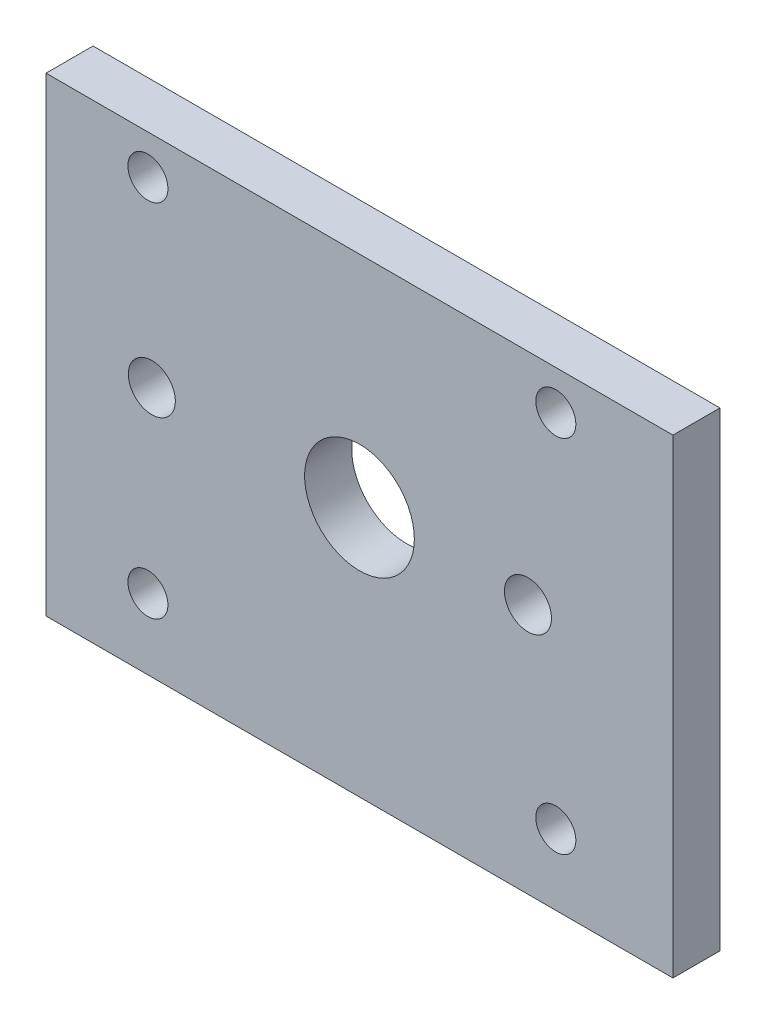
ISO-10303-21;
HEADER;
FILE_DESCRIPTION(('STEP AP214'),'2;1');
FILE_NAME('part.step','',(''),(''),'','','');
FILE_SCHEMA(('AUTOMOTIVE_DESIGN { 1 0 10303 214 1 1 1 1 }'));
ENDSEC;
DATA;
#1=APPLICATION_CONTEXT('core data for automotive mechanical design processes');
#2=APPLICATION_PROTOCOL_DEFINITION('international standard','automotive_design',2000,#1);
#3=PRODUCT_CONTEXT('',#1,'mechanical');
#4=PRODUCT('Part','Part','',(#3));
#5=PRODUCT_RELATED_PRODUCT_CATEGORY('part','',(#4));
#6=PRODUCT_DEFINITION_FORMATION('','',#4);
#7=PRODUCT_DEFINITION_CONTEXT('part definition',#1,'design');
#8=PRODUCT_DEFINITION('design','',#6,#7);
#9=PRODUCT_DEFINITION_SHAPE('','',#8);
#10=(LENGTH_UNIT() NAMED_UNIT(*) SI_UNIT(.MILLI.,.METRE.));
#11=(NAMED_UNIT(*) PLANE_ANGLE_UNIT() SI_UNIT($,.RADIAN.));
#12=(NAMED_UNIT(*) SI_UNIT($,.STERADIAN.) SOLID_ANGLE_UNIT());
#13=UNCERTAINTY_MEASURE_WITH_UNIT(LENGTH_MEASURE(1.E-05),#10,'distance_accuracy_value','');
#14=(GEOMETRIC_REPRESENTATION_CONTEXT(3) GLOBAL_UNCERTAINTY_ASSIGNED_CONTEXT((#13)) GLOBAL_UNIT_ASSIGNED_CONTEXT((#10,
#11,#12)) REPRESENTATION_CONTEXT('',''));
#15=CARTESIAN_POINT('',(0.,0.,0.));
#16=DIRECTION('',(0.,0.,1.));
#17=DIRECTION('',(1.,0.,0.));
#18=AXIS2_PLACEMENT_3D('',#15,#16,#17);
#19=CARTESIAN_POINT('',(0.,0.,6.));
#20=DIRECTION('',(0.,0.,-1.));
#21=DIRECTION('',(-1.,0.,0.));
#22=AXIS2_PLACEMENT_3D('',#19,#20,#21);
#23=PLANE('',#22);
#24=CARTESIAN_POINT('',(25.0526267781055,29.9999999999994,6.));
#25=DIRECTION('',(0.,0.,-1.));
#26=DIRECTION('',(-1.,0.,0.));
#27=AXIS2_PLACEMENT_3D('',#24,#25,#26);
#28=CIRCLE('',#27,2.55508771063859);
#29=CARTESIAN_POINT('',(22.4975390674669,29.9999999999994,6.));
#30=VERTEX_POINT('',#29);
#31=EDGE_CURVE('E123',#30,#30,#28,.T.);
#32=ORIENTED_EDGE('',*,*,#31,.T.);
#33=EDGE_LOOP('',(#32));
#34=FACE_BOUND('',#33,.T.);
#35=CARTESIAN_POINT('',(25.0526267781055,-16.0000000000006,6.));
#36=DIRECTION('',(0.,0.,-1.));
#37=DIRECTION('',(-1.,0.,0.));
#38=AXIS2_PLACEMENT_3D('',#35,#36,#37);
#39=CIRCLE('',#38,2.55508771063859);
#40=CARTESIAN_POINT('',(22.4975390674669,-16.0000000000006,6.));
#41=VERTEX_POINT('',#40);
#42=EDGE_CURVE('E126',#41,#41,#39,.T.);
#43=ORIENTED_EDGE('',*,*,#42,.T.);
#44=EDGE_LOOP('',(#43));
#45=FACE_BOUND('',#44,.T.);
#46=CARTESIAN_POINT('',(-27.0000000000308,-16.0000000000006,6.));
#47=DIRECTION('',(0.,0.,-1.));
#48=DIRECTION('',(-1.,0.,0.));
#49=AXIS2_PLACEMENT_3D('',#46,#47,#48);
#50=CIRCLE('',#49,2.55508771063859);
#51=CARTESIAN_POINT('',(-29.5550877106694,-16.0000000000006,6.));
#52=VERTEX_POINT('',#51);
#53=EDGE_CURVE('E129',#52,#52,#50,.T.);
#54=ORIENTED_EDGE('',*,*,#53,.T.);
#55=EDGE_LOOP('',(#54));
#56=FACE_BOUND('',#55,.T.);
#57=CARTESIAN_POINT('',(-27.0000000000308,29.9999999999994,6.));
#58=DIRECTION('',(0.,0.,-1.));
#59=DIRECTION('',(-1.,0.,0.));
#60=AXIS2_PLACEMENT_3D('',#57,#58,#59);
#61=CIRCLE('',#60,2.55508771063859);
#62=CARTESIAN_POINT('',(-29.5550877106694,29.9999999999994,6.));
#63=VERTEX_POINT('',#62);
#64=EDGE_CURVE('E132',#63,#63,#61,.T.);
#65=ORIENTED_EDGE('',*,*,#64,.T.);
#66=EDGE_LOOP('',(#65));
#67=FACE_BOUND('',#66,.T.);
#68=CARTESIAN_POINT('',(-26.5000000000257,7.00000000000068,6.));
#69=DIRECTION('',(0.,0.,-1.));
#70=DIRECTION('',(-1.,0.,0.));
#71=AXIS2_PLACEMENT_3D('',#68,#69,#70);
#72=CIRCLE('',#71,2.99999999999999);
#73=CARTESIAN_POINT('',(-29.5000000000257,7.00000000000068,6.));
#74=VERTEX_POINT('',#73);
#75=EDGE_CURVE('E135',#74,#74,#72,.T.);
#76=ORIENTED_EDGE('',*,*,#75,.T.);
#77=EDGE_LOOP('',(#76));
#78=FACE_BOUND('',#77,.T.);
#79=CARTESIAN_POINT('',(21.4999999999743,6.99999999999966,6.));
#80=DIRECTION('',(0.,0.,-1.));
#81=DIRECTION('',(-1.,0.,0.));
#82=AXIS2_PLACEMENT_3D('',#79,#80,#81);
#83=CIRCLE('',#82,2.99999999999999);
#84=CARTESIAN_POINT('',(18.4999999999743,6.99999999999966,6.));
#85=VERTEX_POINT('',#84);
#86=EDGE_CURVE('E115',#85,#85,#83,.T.);
#87=ORIENTED_EDGE('',*,*,#86,.T.);
#88=EDGE_LOOP('',(#87));
#89=FACE_BOUND('',#88,.T.);
#90=DIRECTION('',(-1.,0.,0.));
#91=VECTOR('',#90,1.);
#92=CARTESIAN_POINT('',(-40.0000000000308,35.0000000000011,6.));
#93=LINE('',#92,#91);
#94=CARTESIAN_POINT('',(39.9999999999692,34.9999999999994,6.));
#95=VERTEX_POINT('',#94);
#96=CARTESIAN_POINT('',(-40.0000000000308,35.0000000000011,6.));
#97=VERTEX_POINT('',#96);
#98=EDGE_CURVE('E85',#95,#97,#93,.T.);
#99=ORIENTED_EDGE('',*,*,#98,.T.);
#100=DIRECTION('',(0.,-1.,0.));
#101=VECTOR('',#100,1.);
#102=CARTESIAN_POINT('',(-40.000000000032,-24.9999999999989,6.));
#103=LINE('',#102,#101);
#104=CARTESIAN_POINT('',(-40.000000000032,-24.9999999999989,6.));
#105=VERTEX_POINT('',#104);
#106=EDGE_CURVE('E80',#97,#105,#103,.T.);
#107=ORIENTED_EDGE('',*,*,#106,.T.);
#108=DIRECTION('',(1.,0.,0.));
#109=VECTOR('',#108,1.);
#110=CARTESIAN_POINT('',(-40.000000000032,-24.9999999999989,6.));
#111=LINE('',#110,#109);
#112=CARTESIAN_POINT('',(39.999999999968,-24.9999999999989,6.));
#113=VERTEX_POINT('',#112);
#114=EDGE_CURVE('E83',#105,#113,#111,.T.);
#115=ORIENTED_EDGE('',*,*,#114,.T.);
#116=DIRECTION('',(0.,1.,0.));
#117=VECTOR('',#116,1.);
#118=CARTESIAN_POINT('',(39.9999999999692,34.9999999999994,6.));
#119=LINE('',#118,#117);
#120=EDGE_CURVE('E50',#113,#95,#119,.T.);
#121=ORIENTED_EDGE('',*,*,#120,.T.);
#122=EDGE_LOOP('',(#99,#107,#115,#121));
#123=FACE_BOUND('',#122,.T.);
#124=CARTESIAN_POINT('',(-3.13596870453245E-11,7.00000000000025,6.));
#125=DIRECTION('',(0.,0.,1.));
#126=DIRECTION('',(1.,0.,0.));
#127=AXIS2_PLACEMENT_3D('',#124,#125,#126);
#128=CIRCLE('',#127,7.);
#129=CARTESIAN_POINT('',(6.99999999996864,7.00000000000025,6.));
#130=VERTEX_POINT('',#129);
#131=EDGE_CURVE('E100',#130,#130,#128,.T.);
#132=ORIENTED_EDGE('',*,*,#131,.F.);
#133=EDGE_LOOP('',(#132));
#134=FACE_BOUND('',#133,.T.);
#135=ADVANCED_FACE('F33',(#34,#45,#56,#67,#78,#89,#123,#134),#23,.F.);
#136=CARTESIAN_POINT('',(0.,0.,0.));
#137=DIRECTION('',(0.,0.,-1.));
#138=DIRECTION('',(-1.,0.,0.));
#139=AXIS2_PLACEMENT_3D('',#136,#137,#138);
#140=PLANE('',#139);
#141=CARTESIAN_POINT('',(25.0526267781055,29.9999999999994,0.));
#142=DIRECTION('',(0.,0.,-1.));
#143=DIRECTION('',(-1.,0.,0.));
#144=AXIS2_PLACEMENT_3D('',#141,#142,#143);
#145=CIRCLE('',#144,2.55508771063859);
#146=CARTESIAN_POINT('',(22.4975390674669,29.9999999999994,0.));
#147=VERTEX_POINT('',#146);
#148=EDGE_CURVE('E145',#147,#147,#145,.T.);
#149=ORIENTED_EDGE('',*,*,#148,.F.);
#150=EDGE_LOOP('',(#149));
#151=FACE_BOUND('',#150,.T.);
#152=CARTESIAN_POINT('',(25.0526267781055,-16.0000000000006,0.));
#153=DIRECTION('',(0.,0.,-1.));
#154=DIRECTION('',(-1.,0.,0.));
#155=AXIS2_PLACEMENT_3D('',#152,#153,#154);
#156=CIRCLE('',#155,2.55508771063859);
#157=CARTESIAN_POINT('',(22.4975390674669,-16.0000000000006,0.));
#158=VERTEX_POINT('',#157);
#159=EDGE_CURVE('E148',#158,#158,#156,.T.);
#160=ORIENTED_EDGE('',*,*,#159,.F.);
#161=EDGE_LOOP('',(#160));
#162=FACE_BOUND('',#161,.T.);
#163=CARTESIAN_POINT('',(-27.0000000000308,-16.0000000000006,0.));
#164=DIRECTION('',(0.,0.,-1.));
#165=DIRECTION('',(-1.,0.,0.));
#166=AXIS2_PLACEMENT_3D('',#163,#164,#165);
#167=CIRCLE('',#166,2.55508771063859);
#168=CARTESIAN_POINT('',(-29.5550877106694,-16.0000000000006,0.));
#169=VERTEX_POINT('',#168);
#170=EDGE_CURVE('E142',#169,#169,#167,.T.);
#171=ORIENTED_EDGE('',*,*,#170,.F.);
#172=EDGE_LOOP('',(#171));
#173=FACE_BOUND('',#172,.T.);
#174=CARTESIAN_POINT('',(-27.0000000000308,29.9999999999994,0.));
#175=DIRECTION('',(0.,0.,-1.));
#176=DIRECTION('',(-1.,0.,0.));
#177=AXIS2_PLACEMENT_3D('',#174,#175,#176);
#178=CIRCLE('',#177,2.55508771063859);
#179=CARTESIAN_POINT('',(-29.5550877106694,29.9999999999994,0.));
#180=VERTEX_POINT('',#179);
#181=EDGE_CURVE('E139',#180,#180,#178,.T.);
#182=ORIENTED_EDGE('',*,*,#181,.F.);
#183=EDGE_LOOP('',(#182));
#184=FACE_BOUND('',#183,.T.);
#185=CARTESIAN_POINT('',(-26.5000000000257,7.00000000000068,0.));
#186=DIRECTION('',(0.,0.,-1.));
#187=DIRECTION('',(-1.,0.,0.));
#188=AXIS2_PLACEMENT_3D('',#185,#186,#187);
#189=CIRCLE('',#188,2.99999999999999);
#190=CARTESIAN_POINT('',(-29.5000000000257,7.00000000000068,0.));
#191=VERTEX_POINT('',#190);
#192=EDGE_CURVE('E138',#191,#191,#189,.T.);
#193=ORIENTED_EDGE('',*,*,#192,.F.);
#194=EDGE_LOOP('',(#193));
#195=FACE_BOUND('',#194,.T.);
#196=CARTESIAN_POINT('',(21.4999999999743,6.99999999999966,0.));
#197=DIRECTION('',(0.,0.,-1.));
#198=DIRECTION('',(-1.,0.,0.));
#199=AXIS2_PLACEMENT_3D('',#196,#197,#198);
#200=CIRCLE('',#199,2.99999999999999);
#201=CARTESIAN_POINT('',(18.4999999999743,6.99999999999966,0.));
#202=VERTEX_POINT('',#201);
#203=EDGE_CURVE('E120',#202,#202,#200,.T.);
#204=ORIENTED_EDGE('',*,*,#203,.F.);
#205=EDGE_LOOP('',(#204));
#206=FACE_BOUND('',#205,.T.);
#207=DIRECTION('',(-1.,0.,0.));
#208=VECTOR('',#207,1.);
#209=CARTESIAN_POINT('',(-40.0000000000308,35.0000000000011,0.));
#210=LINE('',#209,#208);
#211=CARTESIAN_POINT('',(39.9999999999692,34.9999999999994,0.));
#212=VERTEX_POINT('',#211);
#213=CARTESIAN_POINT('',(-40.0000000000308,35.0000000000011,0.));
#214=VERTEX_POINT('',#213);
#215=EDGE_CURVE('E97',#212,#214,#210,.T.);
#216=ORIENTED_EDGE('',*,*,#215,.F.);
#217=DIRECTION('',(0.,1.,0.));
#218=VECTOR('',#217,1.);
#219=CARTESIAN_POINT('',(39.9999999999692,34.9999999999994,0.));
#220=LINE('',#219,#218);
#221=CARTESIAN_POINT('',(39.999999999968,-24.9999999999989,0.));
#222=VERTEX_POINT('',#221);
#223=EDGE_CURVE('E73',#222,#212,#220,.T.);
#224=ORIENTED_EDGE('',*,*,#223,.F.);
#225=DIRECTION('',(1.,0.,0.));
#226=VECTOR('',#225,1.);
#227=CARTESIAN_POINT('',(-40.000000000032,-24.9999999999989,0.));
#228=LINE('',#227,#226);
#229=CARTESIAN_POINT('',(-40.000000000032,-24.9999999999989,0.));
#230=VERTEX_POINT('',#229);
#231=EDGE_CURVE('E67',#230,#222,#228,.T.);
#232=ORIENTED_EDGE('',*,*,#231,.F.);
#233=DIRECTION('',(0.,-1.,0.));
#234=VECTOR('',#233,1.);
#235=CARTESIAN_POINT('',(-40.000000000032,-24.9999999999989,0.));
#236=LINE('',#235,#234);
#237=EDGE_CURVE('E89',#214,#230,#236,.T.);
#238=ORIENTED_EDGE('',*,*,#237,.F.);
#239=EDGE_LOOP('',(#216,#224,#232,#238));
#240=FACE_BOUND('',#239,.T.);
#241=CARTESIAN_POINT('',(-3.13596870453245E-11,7.00000000000025,0.));
#242=DIRECTION('',(0.,0.,1.));
#243=DIRECTION('',(1.,0.,0.));
#244=AXIS2_PLACEMENT_3D('',#241,#242,#243);
#245=CIRCLE('',#244,7.);
#246=CARTESIAN_POINT('',(6.99999999996864,7.00000000000025,0.));
#247=VERTEX_POINT('',#246);
#248=EDGE_CURVE('E112',#247,#247,#245,.T.);
#249=ORIENTED_EDGE('',*,*,#248,.T.);
#250=EDGE_LOOP('',(#249));
#251=FACE_BOUND('',#250,.T.);
#252=ADVANCED_FACE('F108',(#151,#162,#173,#184,#195,#206,#240,#251),#140,.T.);
#253=CARTESIAN_POINT('',(-40.0000000000308,35.0000000000011,6.));
#254=DIRECTION('',(0.,-1.,0.));
#255=DIRECTION('',(1.,0.,0.));
#256=AXIS2_PLACEMENT_3D('',#253,#254,#255);
#257=PLANE('',#256);
#258=ORIENTED_EDGE('',*,*,#215,.T.);
#259=DIRECTION('',(0.,0.,-1.));
#260=VECTOR('',#259,1.);
#261=CARTESIAN_POINT('',(-40.0000000000308,35.0000000000011,6.));
#262=LINE('',#261,#260);
#263=EDGE_CURVE('E11',#97,#214,#262,.T.);
#264=ORIENTED_EDGE('',*,*,#263,.F.);
#265=ORIENTED_EDGE('',*,*,#98,.F.);
#266=DIRECTION('',(0.,0.,-1.));
#267=VECTOR('',#266,1.);
#268=CARTESIAN_POINT('',(39.9999999999692,34.9999999999994,6.));
#269=LINE('',#268,#267);
#270=EDGE_CURVE('E93',#95,#212,#269,.T.);
#271=ORIENTED_EDGE('',*,*,#270,.T.);
#272=EDGE_LOOP('',(#258,#264,#265,#271));
#273=FACE_BOUND('',#272,.T.);
#274=ADVANCED_FACE('F35',(#273),#257,.F.);
#275=CARTESIAN_POINT('',(-40.000000000032,-24.9999999999989,6.));
#276=DIRECTION('',(1.,0.,0.));
#277=DIRECTION('',(0.,1.,0.));
#278=AXIS2_PLACEMENT_3D('',#275,#276,#277);
#279=PLANE('',#278);
#280=ORIENTED_EDGE('',*,*,#237,.T.);
#281=DIRECTION('',(0.,0.,-1.));
#282=VECTOR('',#281,1.);
#283=CARTESIAN_POINT('',(-40.000000000032,-24.9999999999989,6.));
#284=LINE('',#283,#282);
#285=EDGE_CURVE('E42',#105,#230,#284,.T.);
#286=ORIENTED_EDGE('',*,*,#285,.F.);
#287=ORIENTED_EDGE('',*,*,#106,.F.);
#288=ORIENTED_EDGE('',*,*,#263,.T.);
#289=EDGE_LOOP('',(#280,#286,#287,#288));
#290=FACE_BOUND('',#289,.T.);
#291=ADVANCED_FACE('F88',(#290),#279,.F.);
#292=CARTESIAN_POINT('',(-40.000000000032,-24.9999999999989,6.));
#293=DIRECTION('',(0.,1.,0.));
#294=DIRECTION('',(0.,0.,1.));
#295=AXIS2_PLACEMENT_3D('',#292,#293,#294);
#296=PLANE('',#295);
#297=ORIENTED_EDGE('',*,*,#231,.T.);
#298=DIRECTION('',(0.,0.,-1.));
#299=VECTOR('',#298,1.);
#300=CARTESIAN_POINT('',(39.999999999968,-24.9999999999989,6.));
#301=LINE('',#300,#299);
#302=EDGE_CURVE('E90',#113,#222,#301,.T.);
#303=ORIENTED_EDGE('',*,*,#302,.F.);
#304=ORIENTED_EDGE('',*,*,#114,.F.);
#305=ORIENTED_EDGE('',*,*,#285,.T.);
#306=EDGE_LOOP('',(#297,#303,#304,#305));
#307=FACE_BOUND('',#306,.T.);
#308=ADVANCED_FACE('F91',(#307),#296,.F.);
#309=CARTESIAN_POINT('',(39.9999999999692,34.9999999999994,6.));
#310=DIRECTION('',(-1.,0.,0.));
#311=DIRECTION('',(0.,-1.,0.));
#312=AXIS2_PLACEMENT_3D('',#309,#310,#311);
#313=PLANE('',#312);
#314=ORIENTED_EDGE('',*,*,#223,.T.);
#315=ORIENTED_EDGE('',*,*,#270,.F.);
#316=ORIENTED_EDGE('',*,*,#120,.F.);
#317=ORIENTED_EDGE('',*,*,#302,.T.);
#318=EDGE_LOOP('',(#314,#315,#316,#317));
#319=FACE_BOUND('',#318,.T.);
#320=ADVANCED_FACE('F105',(#319),#313,.F.);
#321=CARTESIAN_POINT('',(-3.13596870453245E-11,7.00000000000025,6.));
#322=DIRECTION('',(0.,0.,-1.));
#323=DIRECTION('',(-1.,0.,0.));
#324=AXIS2_PLACEMENT_3D('',#321,#322,#323);
#325=CYLINDRICAL_SURFACE('',#324,7.);
#326=ORIENTED_EDGE('',*,*,#131,.T.);
#327=EDGE_LOOP('',(#326));
#328=FACE_BOUND('',#327,.T.);
#329=ORIENTED_EDGE('',*,*,#248,.F.);
#330=EDGE_LOOP('',(#329));
#331=FACE_BOUND('',#330,.T.);
#332=ADVANCED_FACE('F171',(#328,#331),#325,.F.);
#333=CARTESIAN_POINT('',(21.4999999999743,6.99999999999966,10.));
#334=DIRECTION('',(0.,0.,-1.));
#335=DIRECTION('',(-1.,0.,0.));
#336=AXIS2_PLACEMENT_3D('',#333,#334,#335);
#337=CYLINDRICAL_SURFACE('',#336,2.99999999999999);
#338=ORIENTED_EDGE('',*,*,#203,.T.);
#339=EDGE_LOOP('',(#338));
#340=FACE_BOUND('',#339,.T.);
#341=ORIENTED_EDGE('',*,*,#86,.F.);
#342=EDGE_LOOP('',(#341));
#343=FACE_BOUND('',#342,.T.);
#344=ADVANCED_FACE('F167',(#340,#343),#337,.F.);
#345=CARTESIAN_POINT('',(-26.5000000000257,7.00000000000068,10.));
#346=DIRECTION('',(0.,0.,-1.));
#347=DIRECTION('',(-1.,0.,0.));
#348=AXIS2_PLACEMENT_3D('',#345,#346,#347);
#349=CYLINDRICAL_SURFACE('',#348,2.99999999999999);
#350=ORIENTED_EDGE('',*,*,#192,.T.);
#351=EDGE_LOOP('',(#350));
#352=FACE_BOUND('',#351,.T.);
#353=ORIENTED_EDGE('',*,*,#75,.F.);
#354=EDGE_LOOP('',(#353));
#355=FACE_BOUND('',#354,.T.);
#356=ADVANCED_FACE('F170',(#352,#355),#349,.F.);
#357=CARTESIAN_POINT('',(-27.0000000000308,29.9999999999994,10.));
#358=DIRECTION('',(0.,0.,-1.));
#359=DIRECTION('',(-1.,0.,0.));
#360=AXIS2_PLACEMENT_3D('',#357,#358,#359);
#361=CYLINDRICAL_SURFACE('',#360,2.55508771063859);
#362=ORIENTED_EDGE('',*,*,#181,.T.);
#363=EDGE_LOOP('',(#362));
#364=FACE_BOUND('',#363,.T.);
#365=ORIENTED_EDGE('',*,*,#64,.F.);
#366=EDGE_LOOP('',(#365));
#367=FACE_BOUND('',#366,.T.);
#368=ADVANCED_FACE('F216',(#364,#367),#361,.F.);
#369=CARTESIAN_POINT('',(-27.0000000000308,-16.0000000000006,10.));
#370=DIRECTION('',(0.,0.,-1.));
#371=DIRECTION('',(-1.,0.,0.));
#372=AXIS2_PLACEMENT_3D('',#369,#370,#371);
#373=CYLINDRICAL_SURFACE('',#372,2.55508771063859);
#374=ORIENTED_EDGE('',*,*,#170,.T.);
#375=EDGE_LOOP('',(#374));
#376=FACE_BOUND('',#375,.T.);
#377=ORIENTED_EDGE('',*,*,#53,.F.);
#378=EDGE_LOOP('',(#377));
#379=FACE_BOUND('',#378,.T.);
#380=ADVANCED_FACE('F154',(#376,#379),#373,.F.);
#381=CARTESIAN_POINT('',(25.0526267781055,-16.0000000000006,10.));
#382=DIRECTION('',(0.,0.,-1.));
#383=DIRECTION('',(-1.,0.,0.));
#384=AXIS2_PLACEMENT_3D('',#381,#382,#383);
#385=CYLINDRICAL_SURFACE('',#384,2.55508771063859);
#386=ORIENTED_EDGE('',*,*,#159,.T.);
#387=EDGE_LOOP('',(#386));
#388=FACE_BOUND('',#387,.T.);
#389=ORIENTED_EDGE('',*,*,#42,.F.);
#390=EDGE_LOOP('',(#389));
#391=FACE_BOUND('',#390,.T.);
#392=ADVANCED_FACE('F235',(#388,#391),#385,.F.);
#393=CARTESIAN_POINT('',(25.0526267781055,29.9999999999994,10.));
#394=DIRECTION('',(0.,0.,-1.));
#395=DIRECTION('',(-1.,0.,0.));
#396=AXIS2_PLACEMENT_3D('',#393,#394,#395);
#397=CYLINDRICAL_SURFACE('',#396,2.55508771063859);
#398=ORIENTED_EDGE('',*,*,#148,.T.);
#399=EDGE_LOOP('',(#398));
#400=FACE_BOUND('',#399,.T.);
#401=ORIENTED_EDGE('',*,*,#31,.F.);
#402=EDGE_LOOP('',(#401));
#403=FACE_BOUND('',#402,.T.);
#404=ADVANCED_FACE('F244',(#400,#403),#397,.F.);
#405=CLOSED_SHELL('',(#135,#252,#274,#291,#308,#320,#332,#344,#356,#368,#380,#392,#404));
#406=MANIFOLD_SOLID_BREP('B2',#405);
#407=ADVANCED_BREP_SHAPE_REPRESENTATION('',(#18,#406),#14);
#408=SHAPE_DEFINITION_REPRESENTATION(#9,#407);
ENDSEC;
END-ISO-10303-21;
